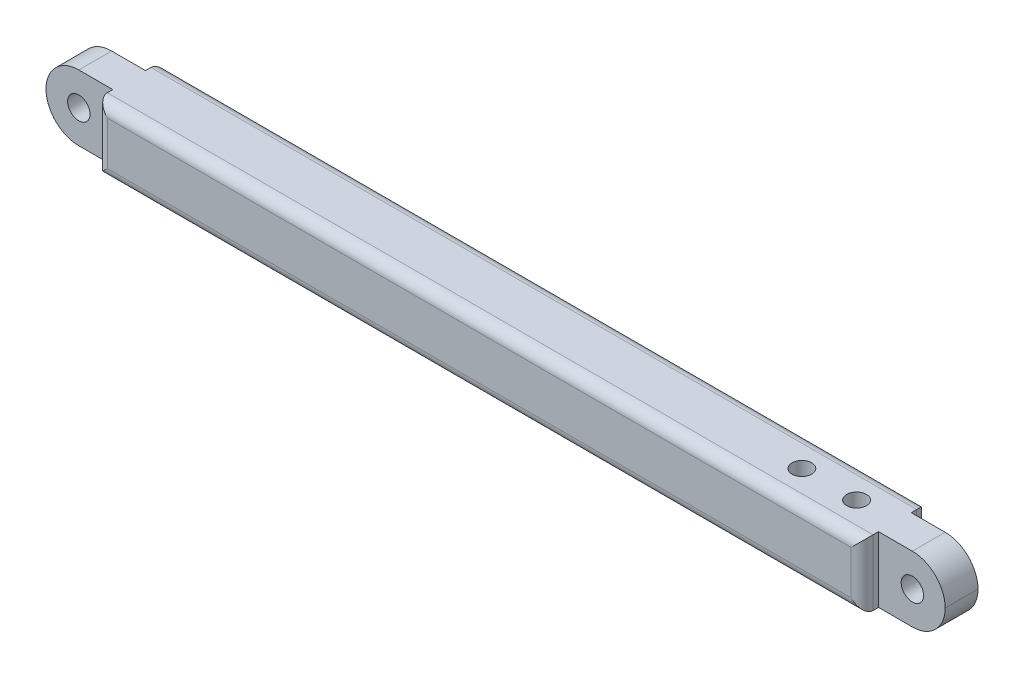
ISO-10303-21;
HEADER;
FILE_DESCRIPTION(('STEP AP214'),'2;1');
FILE_NAME('part.step','',(''),(''),'','','');
FILE_SCHEMA(('AUTOMOTIVE_DESIGN { 1 0 10303 214 1 1 1 1 }'));
ENDSEC;
DATA;
#1=APPLICATION_CONTEXT('core data for automotive mechanical design processes');
#2=APPLICATION_PROTOCOL_DEFINITION('international standard','automotive_design',2000,#1);
#3=PRODUCT_CONTEXT('',#1,'mechanical');
#4=PRODUCT('Part','Part','',(#3));
#5=PRODUCT_RELATED_PRODUCT_CATEGORY('part','',(#4));
#6=PRODUCT_DEFINITION_FORMATION('','',#4);
#7=PRODUCT_DEFINITION_CONTEXT('part definition',#1,'design');
#8=PRODUCT_DEFINITION('design','',#6,#7);
#9=PRODUCT_DEFINITION_SHAPE('','',#8);
#10=(LENGTH_UNIT() NAMED_UNIT(*) SI_UNIT(.MILLI.,.METRE.));
#11=(NAMED_UNIT(*) PLANE_ANGLE_UNIT() SI_UNIT($,.RADIAN.));
#12=(NAMED_UNIT(*) SI_UNIT($,.STERADIAN.) SOLID_ANGLE_UNIT());
#13=UNCERTAINTY_MEASURE_WITH_UNIT(LENGTH_MEASURE(1.E-05),#10,'distance_accuracy_value','');
#14=(GEOMETRIC_REPRESENTATION_CONTEXT(3) GLOBAL_UNCERTAINTY_ASSIGNED_CONTEXT((#13)) GLOBAL_UNIT_ASSIGNED_CONTEXT((#10,
#11,#12)) REPRESENTATION_CONTEXT('',''));
#15=CARTESIAN_POINT('',(0.,0.,0.));
#16=DIRECTION('',(0.,0.,1.));
#17=DIRECTION('',(1.,0.,0.));
#18=AXIS2_PLACEMENT_3D('',#15,#16,#17);
#19=CARTESIAN_POINT('',(70.,6.,0.));
#20=DIRECTION('',(-1.,0.,0.));
#21=DIRECTION('',(0.,0.,1.));
#22=AXIS2_PLACEMENT_3D('',#19,#20,#21);
#23=PLANE('',#22);
#24=DIRECTION('',(0.,0.,-1.));
#25=VECTOR('',#24,1.);
#26=CARTESIAN_POINT('',(70.,6.,0.));
#27=LINE('',#26,#25);
#28=CARTESIAN_POINT('',(70.,6.,-1.));
#29=VERTEX_POINT('',#28);
#30=CARTESIAN_POINT('',(70.,6.,-1.5));
#31=VERTEX_POINT('',#30);
#32=EDGE_CURVE('E193',#29,#31,#27,.T.);
#33=ORIENTED_EDGE('',*,*,#32,.F.);
#34=DIRECTION('',(0.,-1.,0.));
#35=VECTOR('',#34,1.);
#36=CARTESIAN_POINT('',(70.,6.,-1.));
#37=LINE('',#36,#35);
#38=CARTESIAN_POINT('',(70.,0.,-1.));
#39=VERTEX_POINT('',#38);
#40=EDGE_CURVE('E290',#29,#39,#37,.T.);
#41=ORIENTED_EDGE('',*,*,#40,.T.);
#42=DIRECTION('',(0.,0.,-1.));
#43=VECTOR('',#42,1.);
#44=CARTESIAN_POINT('',(70.,0.,0.));
#45=LINE('',#44,#43);
#46=CARTESIAN_POINT('',(70.,0.,-1.5));
#47=VERTEX_POINT('',#46);
#48=EDGE_CURVE('E247',#39,#47,#45,.T.);
#49=ORIENTED_EDGE('',*,*,#48,.T.);
#50=DIRECTION('',(0.,-1.,0.));
#51=VECTOR('',#50,1.);
#52=CARTESIAN_POINT('',(70.,6.,-1.5));
#53=LINE('',#52,#51);
#54=EDGE_CURVE('E199',#31,#47,#53,.T.);
#55=ORIENTED_EDGE('',*,*,#54,.F.);
#56=EDGE_LOOP('',(#33,#41,#49,#55));
#57=FACE_BOUND('',#56,.T.);
#58=ADVANCED_FACE('F44',(#57),#23,.F.);
#59=CARTESIAN_POINT('',(70.,0.,-4.5));
#60=VERTEX_POINT('',#59);
#61=CARTESIAN_POINT('',(70.,0.,-5.));
#62=VERTEX_POINT('',#61);
#63=EDGE_CURVE('E246',#60,#62,#45,.T.);
#64=ORIENTED_EDGE('',*,*,#63,.T.);
#65=DIRECTION('',(0.,-1.,0.));
#66=VECTOR('',#65,1.);
#67=CARTESIAN_POINT('',(70.,6.,-5.));
#68=LINE('',#67,#66);
#69=CARTESIAN_POINT('',(70.,6.,-5.));
#70=VERTEX_POINT('',#69);
#71=EDGE_CURVE('E191',#62,#70,#68,.F.);
#72=ORIENTED_EDGE('',*,*,#71,.T.);
#73=CARTESIAN_POINT('',(70.,6.,-4.5));
#74=VERTEX_POINT('',#73);
#75=EDGE_CURVE('E174',#74,#70,#27,.T.);
#76=ORIENTED_EDGE('',*,*,#75,.F.);
#77=DIRECTION('',(0.,1.,0.));
#78=VECTOR('',#77,1.);
#79=CARTESIAN_POINT('',(70.,6.,-4.5));
#80=LINE('',#79,#78);
#81=EDGE_CURVE('E188',#60,#74,#80,.T.);
#82=ORIENTED_EDGE('',*,*,#81,.F.);
#83=EDGE_LOOP('',(#64,#72,#76,#82));
#84=FACE_BOUND('',#83,.T.);
#85=ADVANCED_FACE('F187',(#84),#23,.F.);
#86=CARTESIAN_POINT('',(0.,6.,0.));
#87=DIRECTION('',(1.,0.,0.));
#88=DIRECTION('',(0.,0.,-1.));
#89=AXIS2_PLACEMENT_3D('',#86,#87,#88);
#90=PLANE('',#89);
#91=DIRECTION('',(0.,0.,1.));
#92=VECTOR('',#91,1.);
#93=CARTESIAN_POINT('',(0.,6.,0.));
#94=LINE('',#93,#92);
#95=CARTESIAN_POINT('',(0.,6.,-5.));
#96=VERTEX_POINT('',#95);
#97=CARTESIAN_POINT('',(0.,6.,-4.5));
#98=VERTEX_POINT('',#97);
#99=EDGE_CURVE('E194',#96,#98,#94,.T.);
#100=ORIENTED_EDGE('',*,*,#99,.F.);
#101=DIRECTION('',(0.,-1.,0.));
#102=VECTOR('',#101,1.);
#103=CARTESIAN_POINT('',(0.,6.,-5.));
#104=LINE('',#103,#102);
#105=CARTESIAN_POINT('',(0.,0.,-5.));
#106=VERTEX_POINT('',#105);
#107=EDGE_CURVE('E273',#96,#106,#104,.T.);
#108=ORIENTED_EDGE('',*,*,#107,.T.);
#109=DIRECTION('',(0.,0.,1.));
#110=VECTOR('',#109,1.);
#111=CARTESIAN_POINT('',(0.,0.,0.));
#112=LINE('',#111,#110);
#113=CARTESIAN_POINT('',(0.,0.,-4.5));
#114=VERTEX_POINT('',#113);
#115=EDGE_CURVE('E242',#106,#114,#112,.T.);
#116=ORIENTED_EDGE('',*,*,#115,.T.);
#117=DIRECTION('',(0.,-1.,0.));
#118=VECTOR('',#117,1.);
#119=CARTESIAN_POINT('',(0.,6.,-4.5));
#120=LINE('',#119,#118);
#121=EDGE_CURVE('E214',#98,#114,#120,.T.);
#122=ORIENTED_EDGE('',*,*,#121,.F.);
#123=EDGE_LOOP('',(#100,#108,#116,#122));
#124=FACE_BOUND('',#123,.T.);
#125=ADVANCED_FACE('F422',(#124),#90,.F.);
#126=CARTESIAN_POINT('',(0.,0.,-1.5));
#127=VERTEX_POINT('',#126);
#128=CARTESIAN_POINT('',(0.,0.,-1.));
#129=VERTEX_POINT('',#128);
#130=EDGE_CURVE('E234',#127,#129,#112,.T.);
#131=ORIENTED_EDGE('',*,*,#130,.T.);
#132=DIRECTION('',(0.,-1.,0.));
#133=VECTOR('',#132,1.);
#134=CARTESIAN_POINT('',(0.,6.,-1.));
#135=LINE('',#134,#133);
#136=CARTESIAN_POINT('',(0.,6.,-1.));
#137=VERTEX_POINT('',#136);
#138=EDGE_CURVE('E269',#129,#137,#135,.F.);
#139=ORIENTED_EDGE('',*,*,#138,.T.);
#140=CARTESIAN_POINT('',(0.,6.,-1.5));
#141=VERTEX_POINT('',#140);
#142=EDGE_CURVE('E237',#141,#137,#94,.T.);
#143=ORIENTED_EDGE('',*,*,#142,.F.);
#144=DIRECTION('',(0.,1.,0.));
#145=VECTOR('',#144,1.);
#146=CARTESIAN_POINT('',(0.,6.,-1.5));
#147=LINE('',#146,#145);
#148=EDGE_CURVE('E218',#127,#141,#147,.T.);
#149=ORIENTED_EDGE('',*,*,#148,.F.);
#150=EDGE_LOOP('',(#131,#139,#143,#149));
#151=FACE_BOUND('',#150,.T.);
#152=ADVANCED_FACE('F431',(#151),#90,.F.);
#153=CARTESIAN_POINT('',(0.,6.,0.));
#154=DIRECTION('',(0.,0.,-1.));
#155=DIRECTION('',(-1.,0.,0.));
#156=AXIS2_PLACEMENT_3D('',#153,#154,#155);
#157=PLANE('',#156);
#158=DIRECTION('',(0.,-1.,0.));
#159=VECTOR('',#158,1.);
#160=CARTESIAN_POINT('',(1.,6.,0.));
#161=LINE('',#160,#159);
#162=CARTESIAN_POINT('',(1.,5.,0.));
#163=VERTEX_POINT('',#162);
#164=CARTESIAN_POINT('',(1.,1.,0.));
#165=VERTEX_POINT('',#164);
#166=EDGE_CURVE('E262',#163,#165,#161,.T.);
#167=ORIENTED_EDGE('',*,*,#166,.T.);
#168=DIRECTION('',(1.,0.,0.));
#169=VECTOR('',#168,1.);
#170=CARTESIAN_POINT('',(70.,1.,0.));
#171=LINE('',#170,#169);
#172=CARTESIAN_POINT('',(69.,1.,0.));
#173=VERTEX_POINT('',#172);
#174=EDGE_CURVE('E266',#165,#173,#171,.T.);
#175=ORIENTED_EDGE('',*,*,#174,.T.);
#176=DIRECTION('',(0.,-1.,0.));
#177=VECTOR('',#176,1.);
#178=CARTESIAN_POINT('',(69.,6.,0.));
#179=LINE('',#178,#177);
#180=CARTESIAN_POINT('',(69.,5.,0.));
#181=VERTEX_POINT('',#180);
#182=EDGE_CURVE('E259',#173,#181,#179,.F.);
#183=ORIENTED_EDGE('',*,*,#182,.T.);
#184=DIRECTION('',(1.,0.,0.));
#185=VECTOR('',#184,1.);
#186=CARTESIAN_POINT('',(0.,5.,0.));
#187=LINE('',#186,#185);
#188=EDGE_CURVE('E241',#181,#163,#187,.F.);
#189=ORIENTED_EDGE('',*,*,#188,.T.);
#190=EDGE_LOOP('',(#167,#175,#183,#189));
#191=FACE_BOUND('',#190,.T.);
#192=ADVANCED_FACE('F428',(#191),#157,.F.);
#193=CARTESIAN_POINT('',(0.,6.,-6.));
#194=DIRECTION('',(0.,0.,1.));
#195=DIRECTION('',(1.,0.,0.));
#196=AXIS2_PLACEMENT_3D('',#193,#194,#195);
#197=PLANE('',#196);
#198=DIRECTION('',(0.,-1.,0.));
#199=VECTOR('',#198,1.);
#200=CARTESIAN_POINT('',(69.,6.,-6.));
#201=LINE('',#200,#199);
#202=CARTESIAN_POINT('',(69.,5.,-6.));
#203=VERTEX_POINT('',#202);
#204=CARTESIAN_POINT('',(69.,1.,-6.));
#205=VERTEX_POINT('',#204);
#206=EDGE_CURVE('E280',#203,#205,#201,.T.);
#207=ORIENTED_EDGE('',*,*,#206,.T.);
#208=DIRECTION('',(-1.,0.,0.));
#209=VECTOR('',#208,1.);
#210=CARTESIAN_POINT('',(0.,1.,-6.));
#211=LINE('',#210,#209);
#212=CARTESIAN_POINT('',(1.,1.,-6.));
#213=VERTEX_POINT('',#212);
#214=EDGE_CURVE('E287',#205,#213,#211,.T.);
#215=ORIENTED_EDGE('',*,*,#214,.T.);
#216=DIRECTION('',(0.,-1.,0.));
#217=VECTOR('',#216,1.);
#218=CARTESIAN_POINT('',(1.,6.,-6.));
#219=LINE('',#218,#217);
#220=CARTESIAN_POINT('',(1.,5.,-6.));
#221=VERTEX_POINT('',#220);
#222=EDGE_CURVE('E283',#213,#221,#219,.F.);
#223=ORIENTED_EDGE('',*,*,#222,.T.);
#224=DIRECTION('',(-1.,0.,0.));
#225=VECTOR('',#224,1.);
#226=CARTESIAN_POINT('',(0.,5.,-6.));
#227=LINE('',#226,#225);
#228=EDGE_CURVE('E277',#221,#203,#227,.F.);
#229=ORIENTED_EDGE('',*,*,#228,.T.);
#230=EDGE_LOOP('',(#207,#215,#223,#229));
#231=FACE_BOUND('',#230,.T.);
#232=ADVANCED_FACE('F426',(#231),#197,.F.);
#233=CARTESIAN_POINT('',(0.,6.,0.));
#234=DIRECTION('',(0.,-1.,0.));
#235=DIRECTION('',(0.,0.,-1.));
#236=AXIS2_PLACEMENT_3D('',#233,#234,#235);
#237=PLANE('',#236);
#238=CARTESIAN_POINT('',(66.5,6.,-3.));
#239=DIRECTION('',(0.,-1.,0.));
#240=DIRECTION('',(0.,0.,-1.));
#241=AXIS2_PLACEMENT_3D('',#238,#239,#240);
#242=CIRCLE('',#241,0.900000000000004);
#243=CARTESIAN_POINT('',(66.5,6.,-3.9));
#244=VERTEX_POINT('',#243);
#245=EDGE_CURVE('E374',#244,#244,#242,.T.);
#246=ORIENTED_EDGE('',*,*,#245,.T.);
#247=EDGE_LOOP('',(#246));
#248=FACE_BOUND('',#247,.T.);
#249=CARTESIAN_POINT('',(61.5,6.,-3.));
#250=DIRECTION('',(0.,-1.,0.));
#251=DIRECTION('',(0.,0.,-1.));
#252=AXIS2_PLACEMENT_3D('',#249,#250,#251);
#253=CIRCLE('',#252,0.899999999999997);
#254=CARTESIAN_POINT('',(61.5,6.,-3.9));
#255=VERTEX_POINT('',#254);
#256=EDGE_CURVE('E379',#255,#255,#253,.T.);
#257=ORIENTED_EDGE('',*,*,#256,.T.);
#258=EDGE_LOOP('',(#257));
#259=FACE_BOUND('',#258,.T.);
#260=DIRECTION('',(1.,0.,0.));
#261=VECTOR('',#260,1.);
#262=CARTESIAN_POINT('',(-6.1,6.,-4.5));
#263=LINE('',#262,#261);
#264=CARTESIAN_POINT('',(-3.1,6.,-4.5));
#265=VERTEX_POINT('',#264);
#266=EDGE_CURVE('E222',#265,#98,#263,.T.);
#267=ORIENTED_EDGE('',*,*,#266,.F.);
#268=DIRECTION('',(0.,0.,-1.));
#269=VECTOR('',#268,1.);
#270=CARTESIAN_POINT('',(-3.1,6.,-1.5));
#271=LINE('',#270,#269);
#272=CARTESIAN_POINT('',(-3.1,6.,-1.5));
#273=VERTEX_POINT('',#272);
#274=EDGE_CURVE('E358',#265,#273,#271,.F.);
#275=ORIENTED_EDGE('',*,*,#274,.T.);
#276=DIRECTION('',(1.,0.,0.));
#277=VECTOR('',#276,1.);
#278=CARTESIAN_POINT('',(-6.1,6.,-1.5));
#279=LINE('',#278,#277);
#280=EDGE_CURVE('E225',#273,#141,#279,.T.);
#281=ORIENTED_EDGE('',*,*,#280,.T.);
#282=ORIENTED_EDGE('',*,*,#142,.T.);
#283=DIRECTION('',(1.,0.,0.));
#284=VECTOR('',#283,1.);
#285=CARTESIAN_POINT('',(0.,6.,-1.));
#286=LINE('',#285,#284);
#287=EDGE_CURVE('E301',#137,#29,#286,.T.);
#288=ORIENTED_EDGE('',*,*,#287,.T.);
#289=ORIENTED_EDGE('',*,*,#32,.T.);
#290=DIRECTION('',(-1.,0.,0.));
#291=VECTOR('',#290,1.);
#292=CARTESIAN_POINT('',(76.1,6.,-1.5));
#293=LINE('',#292,#291);
#294=CARTESIAN_POINT('',(73.1,6.,-1.5));
#295=VERTEX_POINT('',#294);
#296=EDGE_CURVE('E182',#295,#31,#293,.T.);
#297=ORIENTED_EDGE('',*,*,#296,.F.);
#298=DIRECTION('',(0.,0.,1.));
#299=VECTOR('',#298,1.);
#300=CARTESIAN_POINT('',(73.1,6.,-4.5));
#301=LINE('',#300,#299);
#302=CARTESIAN_POINT('',(73.1,6.,-4.5));
#303=VERTEX_POINT('',#302);
#304=EDGE_CURVE('E178',#295,#303,#301,.F.);
#305=ORIENTED_EDGE('',*,*,#304,.T.);
#306=DIRECTION('',(-1.,0.,0.));
#307=VECTOR('',#306,1.);
#308=CARTESIAN_POINT('',(76.1,6.,-4.5));
#309=LINE('',#308,#307);
#310=EDGE_CURVE('E170',#303,#74,#309,.T.);
#311=ORIENTED_EDGE('',*,*,#310,.T.);
#312=ORIENTED_EDGE('',*,*,#75,.T.);
#313=DIRECTION('',(-1.,0.,0.));
#314=VECTOR('',#313,1.);
#315=CARTESIAN_POINT('',(0.,6.,-5.));
#316=LINE('',#315,#314);
#317=EDGE_CURVE('E304',#70,#96,#316,.T.);
#318=ORIENTED_EDGE('',*,*,#317,.T.);
#319=ORIENTED_EDGE('',*,*,#99,.T.);
#320=EDGE_LOOP('',(#267,#275,#281,#282,#288,#289,#297,#305,#311,#312,#318,#319));
#321=FACE_BOUND('',#320,.T.);
#322=ADVANCED_FACE('F173',(#248,#259,#321),#237,.F.);
#323=CARTESIAN_POINT('',(0.,0.,0.));
#324=DIRECTION('',(0.,-1.,0.));
#325=DIRECTION('',(0.,0.,-1.));
#326=AXIS2_PLACEMENT_3D('',#323,#324,#325);
#327=PLANE('',#326);
#328=CARTESIAN_POINT('',(66.5,0.,-3.));
#329=DIRECTION('',(0.,-1.,0.));
#330=DIRECTION('',(0.,0.,-1.));
#331=AXIS2_PLACEMENT_3D('',#328,#329,#330);
#332=CIRCLE('',#331,0.900000000000004);
#333=CARTESIAN_POINT('',(66.5,0.,-3.9));
#334=VERTEX_POINT('',#333);
#335=EDGE_CURVE('E385',#334,#334,#332,.T.);
#336=ORIENTED_EDGE('',*,*,#335,.F.);
#337=EDGE_LOOP('',(#336));
#338=FACE_BOUND('',#337,.T.);
#339=CARTESIAN_POINT('',(61.5,0.,-3.));
#340=DIRECTION('',(0.,-1.,0.));
#341=DIRECTION('',(0.,0.,-1.));
#342=AXIS2_PLACEMENT_3D('',#339,#340,#341);
#343=CIRCLE('',#342,0.899999999999997);
#344=CARTESIAN_POINT('',(61.5,0.,-3.9));
#345=VERTEX_POINT('',#344);
#346=EDGE_CURVE('E554',#345,#345,#343,.T.);
#347=ORIENTED_EDGE('',*,*,#346,.F.);
#348=EDGE_LOOP('',(#347));
#349=FACE_BOUND('',#348,.T.);
#350=DIRECTION('',(1.,0.,0.));
#351=VECTOR('',#350,1.);
#352=CARTESIAN_POINT('',(-6.1,0.,-1.5));
#353=LINE('',#352,#351);
#354=CARTESIAN_POINT('',(-3.1,0.,-1.5));
#355=VERTEX_POINT('',#354);
#356=EDGE_CURVE('E228',#355,#127,#353,.T.);
#357=ORIENTED_EDGE('',*,*,#356,.F.);
#358=DIRECTION('',(0.,0.,1.));
#359=VECTOR('',#358,1.);
#360=CARTESIAN_POINT('',(-3.1,0.,0.));
#361=LINE('',#360,#359);
#362=CARTESIAN_POINT('',(-3.1,0.,-4.5));
#363=VERTEX_POINT('',#362);
#364=EDGE_CURVE('E346',#355,#363,#361,.F.);
#365=ORIENTED_EDGE('',*,*,#364,.T.);
#366=DIRECTION('',(1.,0.,0.));
#367=VECTOR('',#366,1.);
#368=CARTESIAN_POINT('',(-6.1,0.,-4.5));
#369=LINE('',#368,#367);
#370=EDGE_CURVE('E231',#363,#114,#369,.T.);
#371=ORIENTED_EDGE('',*,*,#370,.T.);
#372=ORIENTED_EDGE('',*,*,#115,.F.);
#373=DIRECTION('',(-1.,0.,0.));
#374=VECTOR('',#373,1.);
#375=CARTESIAN_POINT('',(70.,0.,-5.));
#376=LINE('',#375,#374);
#377=EDGE_CURVE('E298',#106,#62,#376,.F.);
#378=ORIENTED_EDGE('',*,*,#377,.T.);
#379=ORIENTED_EDGE('',*,*,#63,.F.);
#380=DIRECTION('',(-1.,0.,0.));
#381=VECTOR('',#380,1.);
#382=CARTESIAN_POINT('',(76.1,0.,-4.5));
#383=LINE('',#382,#381);
#384=CARTESIAN_POINT('',(73.1,0.,-4.5));
#385=VERTEX_POINT('',#384);
#386=EDGE_CURVE('E181',#385,#60,#383,.T.);
#387=ORIENTED_EDGE('',*,*,#386,.F.);
#388=DIRECTION('',(0.,0.,-1.));
#389=VECTOR('',#388,1.);
#390=CARTESIAN_POINT('',(73.1,0.,0.));
#391=LINE('',#390,#389);
#392=CARTESIAN_POINT('',(73.1,0.,-1.5));
#393=VERTEX_POINT('',#392);
#394=EDGE_CURVE('E342',#385,#393,#391,.F.);
#395=ORIENTED_EDGE('',*,*,#394,.T.);
#396=DIRECTION('',(-1.,0.,0.));
#397=VECTOR('',#396,1.);
#398=CARTESIAN_POINT('',(76.1,0.,-1.5));
#399=LINE('',#398,#397);
#400=EDGE_CURVE('E211',#393,#47,#399,.T.);
#401=ORIENTED_EDGE('',*,*,#400,.T.);
#402=ORIENTED_EDGE('',*,*,#48,.F.);
#403=DIRECTION('',(1.,0.,0.));
#404=VECTOR('',#403,1.);
#405=CARTESIAN_POINT('',(0.,0.,-1.));
#406=LINE('',#405,#404);
#407=EDGE_CURVE('E295',#39,#129,#406,.F.);
#408=ORIENTED_EDGE('',*,*,#407,.T.);
#409=ORIENTED_EDGE('',*,*,#130,.F.);
#410=EDGE_LOOP('',(#357,#365,#371,#372,#378,#379,#387,#395,#401,#402,#408,#409));
#411=FACE_BOUND('',#410,.T.);
#412=ADVANCED_FACE('F488',(#338,#349,#411),#327,.T.);
#413=CARTESIAN_POINT('',(-6.1,6.,-4.5));
#414=DIRECTION('',(0.,0.,1.));
#415=DIRECTION('',(1.,0.,0.));
#416=AXIS2_PLACEMENT_3D('',#413,#414,#415);
#417=PLANE('',#416);
#418=CARTESIAN_POINT('',(-3.1,3.,-4.5));
#419=DIRECTION('',(0.,0.,1.));
#420=DIRECTION('',(1.,0.,0.));
#421=AXIS2_PLACEMENT_3D('',#418,#419,#420);
#422=CIRCLE('',#421,1.025);
#423=CARTESIAN_POINT('',(-2.075,3.,-4.5));
#424=VERTEX_POINT('',#423);
#425=EDGE_CURVE('E205',#424,#424,#422,.T.);
#426=ORIENTED_EDGE('',*,*,#425,.T.);
#427=EDGE_LOOP('',(#426));
#428=FACE_BOUND('',#427,.T.);
#429=ORIENTED_EDGE('',*,*,#370,.F.);
#430=CARTESIAN_POINT('',(-3.1,3.,-4.5));
#431=DIRECTION('',(0.,0.,1.));
#432=DIRECTION('',(1.,0.,0.));
#433=AXIS2_PLACEMENT_3D('',#430,#431,#432);
#434=CIRCLE('',#433,3.);
#435=CARTESIAN_POINT('',(-6.1,3.,-4.5));
#436=VERTEX_POINT('',#435);
#437=EDGE_CURVE('E353',#363,#436,#434,.F.);
#438=ORIENTED_EDGE('',*,*,#437,.T.);
#439=CARTESIAN_POINT('',(-3.1,3.,-4.5));
#440=DIRECTION('',(0.,0.,1.));
#441=DIRECTION('',(1.,0.,0.));
#442=AXIS2_PLACEMENT_3D('',#439,#440,#441);
#443=CIRCLE('',#442,3.);
#444=EDGE_CURVE('E350',#436,#265,#443,.F.);
#445=ORIENTED_EDGE('',*,*,#444,.T.);
#446=ORIENTED_EDGE('',*,*,#266,.T.);
#447=ORIENTED_EDGE('',*,*,#121,.T.);
#448=EDGE_LOOP('',(#429,#438,#445,#446,#447));
#449=FACE_BOUND('',#448,.T.);
#450=ADVANCED_FACE('F398',(#428,#449),#417,.F.);
#451=CARTESIAN_POINT('',(-6.1,6.,-1.5));
#452=DIRECTION('',(0.,0.,-1.));
#453=DIRECTION('',(0.,1.,0.));
#454=AXIS2_PLACEMENT_3D('',#451,#452,#453);
#455=PLANE('',#454);
#456=CARTESIAN_POINT('',(-3.1,3.,-1.5));
#457=DIRECTION('',(0.,0.,1.));
#458=DIRECTION('',(1.,0.,0.));
#459=AXIS2_PLACEMENT_3D('',#456,#457,#458);
#460=CIRCLE('',#459,1.025);
#461=CARTESIAN_POINT('',(-2.075,3.,-1.5));
#462=VERTEX_POINT('',#461);
#463=EDGE_CURVE('E255',#462,#462,#460,.T.);
#464=ORIENTED_EDGE('',*,*,#463,.F.);
#465=EDGE_LOOP('',(#464));
#466=FACE_BOUND('',#465,.T.);
#467=CARTESIAN_POINT('',(-3.1,3.,-1.5));
#468=DIRECTION('',(0.,0.,-1.));
#469=DIRECTION('',(0.,1.,0.));
#470=AXIS2_PLACEMENT_3D('',#467,#468,#469);
#471=CIRCLE('',#470,3.);
#472=CARTESIAN_POINT('',(-6.1,3.,-1.5));
#473=VERTEX_POINT('',#472);
#474=EDGE_CURVE('E307',#273,#473,#471,.F.);
#475=ORIENTED_EDGE('',*,*,#474,.T.);
#476=CARTESIAN_POINT('',(-3.1,3.,-1.5));
#477=DIRECTION('',(0.,0.,-1.));
#478=DIRECTION('',(0.,1.,0.));
#479=AXIS2_PLACEMENT_3D('',#476,#477,#478);
#480=CIRCLE('',#479,3.);
#481=EDGE_CURVE('E339',#473,#355,#480,.F.);
#482=ORIENTED_EDGE('',*,*,#481,.T.);
#483=ORIENTED_EDGE('',*,*,#356,.T.);
#484=ORIENTED_EDGE('',*,*,#148,.T.);
#485=ORIENTED_EDGE('',*,*,#280,.F.);
#486=EDGE_LOOP('',(#475,#482,#483,#484,#485));
#487=FACE_BOUND('',#486,.T.);
#488=ADVANCED_FACE('F531',(#466,#487),#455,.F.);
#489=CARTESIAN_POINT('',(76.1,6.,-1.5));
#490=DIRECTION('',(0.,0.,-1.));
#491=DIRECTION('',(-1.,0.,0.));
#492=AXIS2_PLACEMENT_3D('',#489,#490,#491);
#493=PLANE('',#492);
#494=CARTESIAN_POINT('',(73.1,3.,-1.5));
#495=DIRECTION('',(0.,0.,1.));
#496=DIRECTION('',(1.,0.,0.));
#497=AXIS2_PLACEMENT_3D('',#494,#495,#496);
#498=CIRCLE('',#497,1.025);
#499=CARTESIAN_POINT('',(74.125,3.,-1.5));
#500=VERTEX_POINT('',#499);
#501=EDGE_CURVE('E256',#500,#500,#498,.T.);
#502=ORIENTED_EDGE('',*,*,#501,.F.);
#503=EDGE_LOOP('',(#502));
#504=FACE_BOUND('',#503,.T.);
#505=ORIENTED_EDGE('',*,*,#400,.F.);
#506=CARTESIAN_POINT('',(73.1,3.,-1.5));
#507=DIRECTION('',(0.,0.,-1.));
#508=DIRECTION('',(-1.,0.,0.));
#509=AXIS2_PLACEMENT_3D('',#506,#507,#508);
#510=CIRCLE('',#509,3.);
#511=CARTESIAN_POINT('',(76.1,3.,-1.5));
#512=VERTEX_POINT('',#511);
#513=EDGE_CURVE('E11',#393,#512,#510,.F.);
#514=ORIENTED_EDGE('',*,*,#513,.T.);
#515=CARTESIAN_POINT('',(73.1,3.,-1.5));
#516=DIRECTION('',(0.,0.,-1.));
#517=DIRECTION('',(-1.,0.,0.));
#518=AXIS2_PLACEMENT_3D('',#515,#516,#517);
#519=CIRCLE('',#518,3.);
#520=EDGE_CURVE('E54',#512,#295,#519,.F.);
#521=ORIENTED_EDGE('',*,*,#520,.T.);
#522=ORIENTED_EDGE('',*,*,#296,.T.);
#523=ORIENTED_EDGE('',*,*,#54,.T.);
#524=EDGE_LOOP('',(#505,#514,#521,#522,#523));
#525=FACE_BOUND('',#524,.T.);
#526=ADVANCED_FACE('F413',(#504,#525),#493,.F.);
#527=CARTESIAN_POINT('',(76.1,6.,-4.5));
#528=DIRECTION('',(0.,0.,1.));
#529=DIRECTION('',(0.,-1.,0.));
#530=AXIS2_PLACEMENT_3D('',#527,#528,#529);
#531=PLANE('',#530);
#532=CARTESIAN_POINT('',(73.1,3.,-4.5));
#533=DIRECTION('',(0.,0.,1.));
#534=DIRECTION('',(0.,-1.,0.));
#535=AXIS2_PLACEMENT_3D('',#532,#533,#534);
#536=CIRCLE('',#535,1.025);
#537=CARTESIAN_POINT('',(73.1,1.975,-4.5));
#538=VERTEX_POINT('',#537);
#539=EDGE_CURVE('E251',#538,#538,#536,.T.);
#540=ORIENTED_EDGE('',*,*,#539,.T.);
#541=EDGE_LOOP('',(#540));
#542=FACE_BOUND('',#541,.T.);
#543=CARTESIAN_POINT('',(73.1,3.,-4.5));
#544=DIRECTION('',(0.,0.,1.));
#545=DIRECTION('',(0.,-1.,0.));
#546=AXIS2_PLACEMENT_3D('',#543,#544,#545);
#547=CIRCLE('',#546,3.);
#548=CARTESIAN_POINT('',(76.1,3.,-4.5));
#549=VERTEX_POINT('',#548);
#550=EDGE_CURVE('E68',#303,#549,#547,.F.);
#551=ORIENTED_EDGE('',*,*,#550,.T.);
#552=CARTESIAN_POINT('',(73.1,3.,-4.5));
#553=DIRECTION('',(0.,0.,1.));
#554=DIRECTION('',(0.,-1.,0.));
#555=AXIS2_PLACEMENT_3D('',#552,#553,#554);
#556=CIRCLE('',#555,3.);
#557=EDGE_CURVE('E363',#549,#385,#556,.F.);
#558=ORIENTED_EDGE('',*,*,#557,.T.);
#559=ORIENTED_EDGE('',*,*,#386,.T.);
#560=ORIENTED_EDGE('',*,*,#81,.T.);
#561=ORIENTED_EDGE('',*,*,#310,.F.);
#562=EDGE_LOOP('',(#551,#558,#559,#560,#561));
#563=FACE_BOUND('',#562,.T.);
#564=ADVANCED_FACE('F196',(#542,#563),#531,.F.);
#565=CARTESIAN_POINT('',(-3.1,3.,-9.5));
#566=DIRECTION('',(0.,0.,1.));
#567=DIRECTION('',(1.,0.,0.));
#568=AXIS2_PLACEMENT_3D('',#565,#566,#567);
#569=CYLINDRICAL_SURFACE('',#568,1.025);
#570=ORIENTED_EDGE('',*,*,#463,.T.);
#571=EDGE_LOOP('',(#570));
#572=FACE_BOUND('',#571,.T.);
#573=ORIENTED_EDGE('',*,*,#425,.F.);
#574=EDGE_LOOP('',(#573));
#575=FACE_BOUND('',#574,.T.);
#576=ADVANCED_FACE('F401',(#572,#575),#569,.F.);
#577=CARTESIAN_POINT('',(73.1,3.,-9.5));
#578=DIRECTION('',(0.,0.,1.));
#579=DIRECTION('',(1.,0.,0.));
#580=AXIS2_PLACEMENT_3D('',#577,#578,#579);
#581=CYLINDRICAL_SURFACE('',#580,1.025);
#582=ORIENTED_EDGE('',*,*,#501,.T.);
#583=EDGE_LOOP('',(#582));
#584=FACE_BOUND('',#583,.T.);
#585=ORIENTED_EDGE('',*,*,#539,.F.);
#586=EDGE_LOOP('',(#585));
#587=FACE_BOUND('',#586,.T.);
#588=ADVANCED_FACE('F403',(#584,#587),#581,.F.);
#589=CARTESIAN_POINT('',(69.,6.,-1.));
#590=DIRECTION('',(0.,-1.,0.));
#591=DIRECTION('',(0.,0.,-1.));
#592=AXIS2_PLACEMENT_3D('',#589,#590,#591);
#593=CYLINDRICAL_SURFACE('',#592,1.);
#594=CARTESIAN_POINT('',(69.,1.,-1.));
#595=DIRECTION('',(-0.707106781186547,-0.707106781186547,0.));
#596=DIRECTION('',(-0.707106781186547,0.707106781186547,0.));
#597=AXIS2_PLACEMENT_3D('',#594,#595,#596);
#598=ELLIPSE('',#597,1.41421356237309,1.);
#599=EDGE_CURVE('E315',#39,#173,#598,.T.);
#600=ORIENTED_EDGE('',*,*,#599,.F.);
#601=ORIENTED_EDGE('',*,*,#40,.F.);
#602=CARTESIAN_POINT('',(69.,5.,-1.));
#603=DIRECTION('',(0.707106781186547,-0.707106781186547,0.));
#604=DIRECTION('',(0.707106781186547,0.707106781186547,0.));
#605=AXIS2_PLACEMENT_3D('',#602,#603,#604);
#606=ELLIPSE('',#605,1.41421356237309,1.);
#607=EDGE_CURVE('E319',#181,#29,#606,.F.);
#608=ORIENTED_EDGE('',*,*,#607,.F.);
#609=ORIENTED_EDGE('',*,*,#182,.F.);
#610=EDGE_LOOP('',(#600,#601,#608,#609));
#611=FACE_BOUND('',#610,.T.);
#612=ADVANCED_FACE('F409',(#611),#593,.T.);
#613=CARTESIAN_POINT('',(0.,5.,-1.));
#614=DIRECTION('',(1.,0.,0.));
#615=DIRECTION('',(0.,0.,-1.));
#616=AXIS2_PLACEMENT_3D('',#613,#614,#615);
#617=CYLINDRICAL_SURFACE('',#616,1.);
#618=ORIENTED_EDGE('',*,*,#607,.T.);
#619=ORIENTED_EDGE('',*,*,#287,.F.);
#620=CARTESIAN_POINT('',(1.,5.,-1.));
#621=DIRECTION('',(0.707106781186547,0.707106781186547,0.));
#622=DIRECTION('',(0.707106781186547,-0.707106781186547,0.));
#623=AXIS2_PLACEMENT_3D('',#620,#621,#622);
#624=ELLIPSE('',#623,1.41421356237309,1.);
#625=EDGE_CURVE('E311',#163,#137,#624,.F.);
#626=ORIENTED_EDGE('',*,*,#625,.F.);
#627=ORIENTED_EDGE('',*,*,#188,.F.);
#628=EDGE_LOOP('',(#618,#619,#626,#627));
#629=FACE_BOUND('',#628,.T.);
#630=ADVANCED_FACE('F444',(#629),#617,.T.);
#631=CARTESIAN_POINT('',(0.,1.,-1.));
#632=DIRECTION('',(-1.,0.,0.));
#633=DIRECTION('',(0.,0.,1.));
#634=AXIS2_PLACEMENT_3D('',#631,#632,#633);
#635=CYLINDRICAL_SURFACE('',#634,1.);
#636=ORIENTED_EDGE('',*,*,#599,.T.);
#637=ORIENTED_EDGE('',*,*,#174,.F.);
#638=CARTESIAN_POINT('',(1.,1.,-1.));
#639=DIRECTION('',(-0.707106781186547,0.707106781186547,0.));
#640=DIRECTION('',(-0.707106781186547,-0.707106781186547,0.));
#641=AXIS2_PLACEMENT_3D('',#638,#639,#640);
#642=ELLIPSE('',#641,1.41421356237309,1.);
#643=EDGE_CURVE('E308',#129,#165,#642,.T.);
#644=ORIENTED_EDGE('',*,*,#643,.F.);
#645=ORIENTED_EDGE('',*,*,#407,.F.);
#646=EDGE_LOOP('',(#636,#637,#644,#645));
#647=FACE_BOUND('',#646,.T.);
#648=ADVANCED_FACE('F440',(#647),#635,.T.);
#649=CARTESIAN_POINT('',(1.,6.,-1.));
#650=DIRECTION('',(0.,-1.,0.));
#651=DIRECTION('',(0.,0.,-1.));
#652=AXIS2_PLACEMENT_3D('',#649,#650,#651);
#653=CYLINDRICAL_SURFACE('',#652,1.);
#654=ORIENTED_EDGE('',*,*,#625,.T.);
#655=ORIENTED_EDGE('',*,*,#138,.F.);
#656=ORIENTED_EDGE('',*,*,#643,.T.);
#657=ORIENTED_EDGE('',*,*,#166,.F.);
#658=EDGE_LOOP('',(#654,#655,#656,#657));
#659=FACE_BOUND('',#658,.T.);
#660=ADVANCED_FACE('F436',(#659),#653,.T.);
#661=CARTESIAN_POINT('',(69.,6.,-5.));
#662=DIRECTION('',(0.,-1.,0.));
#663=DIRECTION('',(0.,0.,-1.));
#664=AXIS2_PLACEMENT_3D('',#661,#662,#663);
#665=CYLINDRICAL_SURFACE('',#664,1.);
#666=CARTESIAN_POINT('',(69.,1.,-5.));
#667=DIRECTION('',(0.707106781186547,0.707106781186547,0.));
#668=DIRECTION('',(0.707106781186547,-0.707106781186547,0.));
#669=AXIS2_PLACEMENT_3D('',#666,#667,#668);
#670=ELLIPSE('',#669,1.41421356237309,1.);
#671=EDGE_CURVE('E330',#205,#62,#670,.F.);
#672=ORIENTED_EDGE('',*,*,#671,.F.);
#673=ORIENTED_EDGE('',*,*,#206,.F.);
#674=CARTESIAN_POINT('',(69.,5.,-5.));
#675=DIRECTION('',(-0.707106781186547,0.707106781186547,0.));
#676=DIRECTION('',(-0.707106781186547,-0.707106781186547,0.));
#677=AXIS2_PLACEMENT_3D('',#674,#675,#676);
#678=ELLIPSE('',#677,1.41421356237309,1.);
#679=EDGE_CURVE('E312',#70,#203,#678,.T.);
#680=ORIENTED_EDGE('',*,*,#679,.F.);
#681=ORIENTED_EDGE('',*,*,#71,.F.);
#682=EDGE_LOOP('',(#672,#673,#680,#681));
#683=FACE_BOUND('',#682,.T.);
#684=ADVANCED_FACE('F439',(#683),#665,.T.);
#685=CARTESIAN_POINT('',(0.,5.,-5.));
#686=DIRECTION('',(-1.,0.,0.));
#687=DIRECTION('',(0.,0.,1.));
#688=AXIS2_PLACEMENT_3D('',#685,#686,#687);
#689=CYLINDRICAL_SURFACE('',#688,1.);
#690=ORIENTED_EDGE('',*,*,#679,.T.);
#691=ORIENTED_EDGE('',*,*,#228,.F.);
#692=CARTESIAN_POINT('',(1.,5.,-5.));
#693=DIRECTION('',(-0.707106781186547,-0.707106781186547,0.));
#694=DIRECTION('',(-0.707106781186547,0.707106781186547,0.));
#695=AXIS2_PLACEMENT_3D('',#692,#693,#694);
#696=ELLIPSE('',#695,1.41421356237309,1.);
#697=EDGE_CURVE('E326',#96,#221,#696,.T.);
#698=ORIENTED_EDGE('',*,*,#697,.F.);
#699=ORIENTED_EDGE('',*,*,#317,.F.);
#700=EDGE_LOOP('',(#690,#691,#698,#699));
#701=FACE_BOUND('',#700,.T.);
#702=ADVANCED_FACE('F460',(#701),#689,.T.);
#703=CARTESIAN_POINT('',(0.,1.,-5.));
#704=DIRECTION('',(1.,0.,0.));
#705=DIRECTION('',(0.,0.,-1.));
#706=AXIS2_PLACEMENT_3D('',#703,#704,#705);
#707=CYLINDRICAL_SURFACE('',#706,1.);
#708=ORIENTED_EDGE('',*,*,#671,.T.);
#709=ORIENTED_EDGE('',*,*,#377,.F.);
#710=CARTESIAN_POINT('',(1.,1.,-5.));
#711=DIRECTION('',(0.707106781186547,-0.707106781186547,0.));
#712=DIRECTION('',(0.707106781186547,0.707106781186547,0.));
#713=AXIS2_PLACEMENT_3D('',#710,#711,#712);
#714=ELLIPSE('',#713,1.41421356237309,1.);
#715=EDGE_CURVE('E323',#213,#106,#714,.F.);
#716=ORIENTED_EDGE('',*,*,#715,.F.);
#717=ORIENTED_EDGE('',*,*,#214,.F.);
#718=EDGE_LOOP('',(#708,#709,#716,#717));
#719=FACE_BOUND('',#718,.T.);
#720=ADVANCED_FACE('F456',(#719),#707,.T.);
#721=CARTESIAN_POINT('',(1.,6.,-5.));
#722=DIRECTION('',(0.,-1.,0.));
#723=DIRECTION('',(0.,0.,-1.));
#724=AXIS2_PLACEMENT_3D('',#721,#722,#723);
#725=CYLINDRICAL_SURFACE('',#724,1.);
#726=ORIENTED_EDGE('',*,*,#697,.T.);
#727=ORIENTED_EDGE('',*,*,#222,.F.);
#728=ORIENTED_EDGE('',*,*,#715,.T.);
#729=ORIENTED_EDGE('',*,*,#107,.F.);
#730=EDGE_LOOP('',(#726,#727,#728,#729));
#731=FACE_BOUND('',#730,.T.);
#732=ADVANCED_FACE('F452',(#731),#725,.T.);
#733=CARTESIAN_POINT('',(-3.1,3.,0.));
#734=DIRECTION('',(0.,0.,1.));
#735=DIRECTION('',(1.,0.,0.));
#736=AXIS2_PLACEMENT_3D('',#733,#734,#735);
#737=CYLINDRICAL_SURFACE('',#736,3.);
#738=ORIENTED_EDGE('',*,*,#274,.F.);
#739=ORIENTED_EDGE('',*,*,#444,.F.);
#740=DIRECTION('',(0.,0.,-1.));
#741=VECTOR('',#740,1.);
#742=CARTESIAN_POINT('',(-6.1,3.,-4.5));
#743=LINE('',#742,#741);
#744=EDGE_CURVE('E327',#473,#436,#743,.T.);
#745=ORIENTED_EDGE('',*,*,#744,.F.);
#746=ORIENTED_EDGE('',*,*,#474,.F.);
#747=EDGE_LOOP('',(#738,#739,#745,#746));
#748=FACE_BOUND('',#747,.T.);
#749=ADVANCED_FACE('F455',(#748),#737,.T.);
#750=CARTESIAN_POINT('',(-3.1,3.,0.));
#751=DIRECTION('',(0.,0.,1.));
#752=DIRECTION('',(1.,0.,0.));
#753=AXIS2_PLACEMENT_3D('',#750,#751,#752);
#754=CYLINDRICAL_SURFACE('',#753,3.);
#755=ORIENTED_EDGE('',*,*,#437,.F.);
#756=ORIENTED_EDGE('',*,*,#364,.F.);
#757=ORIENTED_EDGE('',*,*,#481,.F.);
#758=ORIENTED_EDGE('',*,*,#744,.T.);
#759=EDGE_LOOP('',(#755,#756,#757,#758));
#760=FACE_BOUND('',#759,.T.);
#761=ADVANCED_FACE('F468',(#760),#754,.T.);
#762=CARTESIAN_POINT('',(73.1,3.,0.));
#763=DIRECTION('',(0.,0.,-1.));
#764=DIRECTION('',(-1.,0.,0.));
#765=AXIS2_PLACEMENT_3D('',#762,#763,#764);
#766=CYLINDRICAL_SURFACE('',#765,3.);
#767=ORIENTED_EDGE('',*,*,#304,.F.);
#768=ORIENTED_EDGE('',*,*,#520,.F.);
#769=DIRECTION('',(0.,0.,1.));
#770=VECTOR('',#769,1.);
#771=CARTESIAN_POINT('',(76.1,3.,-1.5));
#772=LINE('',#771,#770);
#773=EDGE_CURVE('E48',#549,#512,#772,.T.);
#774=ORIENTED_EDGE('',*,*,#773,.F.);
#775=ORIENTED_EDGE('',*,*,#550,.F.);
#776=EDGE_LOOP('',(#767,#768,#774,#775));
#777=FACE_BOUND('',#776,.T.);
#778=ADVANCED_FACE('F46',(#777),#766,.T.);
#779=CARTESIAN_POINT('',(73.1,3.,0.));
#780=DIRECTION('',(0.,0.,-1.));
#781=DIRECTION('',(-1.,0.,0.));
#782=AXIS2_PLACEMENT_3D('',#779,#780,#781);
#783=CYLINDRICAL_SURFACE('',#782,3.);
#784=ORIENTED_EDGE('',*,*,#513,.F.);
#785=ORIENTED_EDGE('',*,*,#394,.F.);
#786=ORIENTED_EDGE('',*,*,#557,.F.);
#787=ORIENTED_EDGE('',*,*,#773,.T.);
#788=EDGE_LOOP('',(#784,#785,#786,#787));
#789=FACE_BOUND('',#788,.T.);
#790=ADVANCED_FACE('F473',(#789),#783,.T.);
#791=CARTESIAN_POINT('',(61.5,10.,-3.));
#792=DIRECTION('',(0.,-1.,0.));
#793=DIRECTION('',(0.,0.,-1.));
#794=AXIS2_PLACEMENT_3D('',#791,#792,#793);
#795=CYLINDRICAL_SURFACE('',#794,0.899999999999997);
#796=ORIENTED_EDGE('',*,*,#346,.T.);
#797=EDGE_LOOP('',(#796));
#798=FACE_BOUND('',#797,.T.);
#799=ORIENTED_EDGE('',*,*,#256,.F.);
#800=EDGE_LOOP('',(#799));
#801=FACE_BOUND('',#800,.T.);
#802=ADVANCED_FACE('F475',(#798,#801),#795,.F.);
#803=CARTESIAN_POINT('',(66.5,10.,-3.));
#804=DIRECTION('',(0.,-1.,0.));
#805=DIRECTION('',(0.,0.,-1.));
#806=AXIS2_PLACEMENT_3D('',#803,#804,#805);
#807=CYLINDRICAL_SURFACE('',#806,0.900000000000004);
#808=ORIENTED_EDGE('',*,*,#335,.T.);
#809=EDGE_LOOP('',(#808));
#810=FACE_BOUND('',#809,.T.);
#811=ORIENTED_EDGE('',*,*,#245,.F.);
#812=EDGE_LOOP('',(#811));
#813=FACE_BOUND('',#812,.T.);
#814=ADVANCED_FACE('F481',(#810,#813),#807,.F.);
#815=CLOSED_SHELL('',(#58,#85,#125,#152,#192,#232,#322,#412,#450,#488,#526,#564,#576,#588,#612,
#630,#648,#660,#684,#702,#720,#732,#749,#761,#778,#790,#802,#814));
#816=MANIFOLD_SOLID_BREP('B2',#815);
#817=ADVANCED_BREP_SHAPE_REPRESENTATION('',(#18,#816),#14);
#818=SHAPE_DEFINITION_REPRESENTATION(#9,#817);
ENDSEC;
END-ISO-10303-21;
